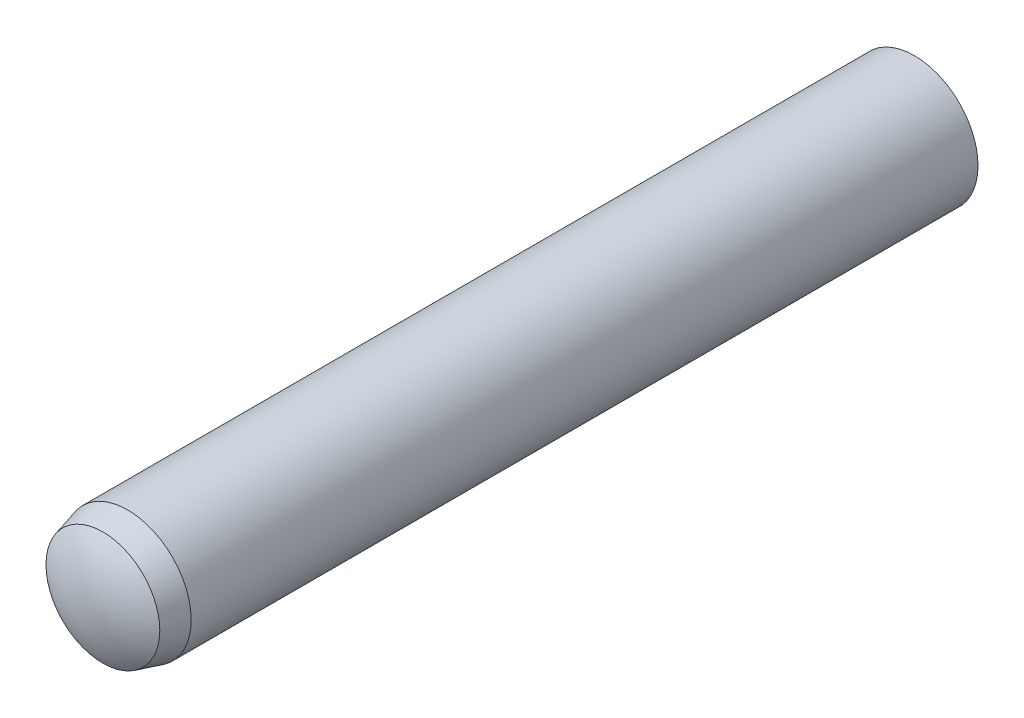
ISO-10303-21;
HEADER;
FILE_DESCRIPTION(('STEP AP214'),'2;1');
FILE_NAME('part.step','',(''),(''),'','','');
FILE_SCHEMA(('AUTOMOTIVE_DESIGN { 1 0 10303 214 1 1 1 1 }'));
ENDSEC;
DATA;
#1=APPLICATION_CONTEXT('core data for automotive mechanical design processes');
#2=APPLICATION_PROTOCOL_DEFINITION('international standard','automotive_design',2000,#1);
#3=PRODUCT_CONTEXT('',#1,'mechanical');
#4=PRODUCT('Part','Part','',(#3));
#5=PRODUCT_RELATED_PRODUCT_CATEGORY('part','',(#4));
#6=PRODUCT_DEFINITION_FORMATION('','',#4);
#7=PRODUCT_DEFINITION_CONTEXT('part definition',#1,'design');
#8=PRODUCT_DEFINITION('design','',#6,#7);
#9=PRODUCT_DEFINITION_SHAPE('','',#8);
#10=(LENGTH_UNIT() NAMED_UNIT(*) SI_UNIT(.MILLI.,.METRE.));
#11=(NAMED_UNIT(*) PLANE_ANGLE_UNIT() SI_UNIT($,.RADIAN.));
#12=(NAMED_UNIT(*) SI_UNIT($,.STERADIAN.) SOLID_ANGLE_UNIT());
#13=UNCERTAINTY_MEASURE_WITH_UNIT(LENGTH_MEASURE(1.E-05),#10,'distance_accuracy_value','');
#14=(GEOMETRIC_REPRESENTATION_CONTEXT(3) GLOBAL_UNCERTAINTY_ASSIGNED_CONTEXT((#13)) GLOBAL_UNIT_ASSIGNED_CONTEXT((#10,
#11,#12)) REPRESENTATION_CONTEXT('',''));
#15=CARTESIAN_POINT('',(0.,0.,0.));
#16=DIRECTION('',(0.,0.,1.));
#17=DIRECTION('',(1.,0.,0.));
#18=AXIS2_PLACEMENT_3D('',#15,#16,#17);
#19=CARTESIAN_POINT('',(0.,0.,-7.27499999999998));
#20=DIRECTION('',(0.,0.,1.));
#21=DIRECTION('',(0.,1.,0.));
#22=AXIS2_PLACEMENT_3D('',#19,#20,#21);
#23=SPHERICAL_SURFACE('',#22,2.72500000000002);
#24=CARTESIAN_POINT('',(0.,0.,-9.55));
#25=DIRECTION('',(0.,0.,1.));
#26=DIRECTION('',(0.,-1.,0.));
#27=AXIS2_PLACEMENT_3D('',#24,#25,#26);
#28=CIRCLE('',#27,1.5);
#29=CARTESIAN_POINT('',(0.,-1.49999999999999,-9.55));
#30=VERTEX_POINT('',#29);
#31=EDGE_CURVE('E10',#30,#30,#28,.T.);
#32=ORIENTED_EDGE('',*,*,#31,.F.);
#33=EDGE_LOOP('',(#32));
#34=FACE_BOUND('',#33,.T.);
#35=ADVANCED_FACE('F35',(#34),#23,.T.);
#36=CARTESIAN_POINT('',(0.,0.,10.));
#37=DIRECTION('',(0.,0.,1.));
#38=DIRECTION('',(0.,-1.,0.));
#39=AXIS2_PLACEMENT_3D('',#36,#37,#38);
#40=CYLINDRICAL_SURFACE('',#39,1.5);
#41=CARTESIAN_POINT('',(0.,0.,9.025));
#42=DIRECTION('',(0.,0.,1.));
#43=DIRECTION('',(0.,-1.,0.));
#44=AXIS2_PLACEMENT_3D('',#41,#42,#43);
#45=CIRCLE('',#44,1.5);
#46=CARTESIAN_POINT('',(0.,-1.5,9.025));
#47=VERTEX_POINT('',#46);
#48=EDGE_CURVE('E41',#47,#47,#45,.T.);
#49=ORIENTED_EDGE('',*,*,#48,.F.);
#50=EDGE_LOOP('',(#49));
#51=FACE_BOUND('',#50,.T.);
#52=ORIENTED_EDGE('',*,*,#31,.T.);
#53=EDGE_LOOP('',(#52));
#54=FACE_BOUND('',#53,.T.);
#55=ADVANCED_FACE('F56',(#51,#54),#40,.T.);
#56=CARTESIAN_POINT('',(0.,0.,9.025));
#57=DIRECTION('',(0.,0.,-1.));
#58=DIRECTION('',(0.,1.,0.));
#59=AXIS2_PLACEMENT_3D('',#56,#57,#58);
#60=CONICAL_SURFACE('',#59,1.5,0.261799387799152);
#61=CARTESIAN_POINT('',(0.,0.,9.61));
#62=DIRECTION('',(0.,0.,1.));
#63=DIRECTION('',(0.,-1.,0.));
#64=AXIS2_PLACEMENT_3D('',#61,#62,#63);
#65=CIRCLE('',#64,1.34324972242779);
#66=CARTESIAN_POINT('',(0.,-1.34324972242779,9.61));
#67=VERTEX_POINT('',#66);
#68=EDGE_CURVE('E45',#67,#67,#65,.T.);
#69=ORIENTED_EDGE('',*,*,#68,.F.);
#70=EDGE_LOOP('',(#69));
#71=FACE_BOUND('',#70,.T.);
#72=ORIENTED_EDGE('',*,*,#48,.T.);
#73=EDGE_LOOP('',(#72));
#74=FACE_BOUND('',#73,.T.);
#75=ADVANCED_FACE('F54',(#71,#74),#60,.T.);
#76=CARTESIAN_POINT('',(0.,0.,7.49176946563802));
#77=DIRECTION('',(0.,0.,1.));
#78=DIRECTION('',(0.,1.,0.));
#79=AXIS2_PLACEMENT_3D('',#76,#77,#78);
#80=SPHERICAL_SURFACE('',#79,2.50823053436198);
#81=ORIENTED_EDGE('',*,*,#68,.T.);
#82=EDGE_LOOP('',(#81));
#83=FACE_BOUND('',#82,.T.);
#84=ADVANCED_FACE('F52',(#83),#80,.T.);
#85=CLOSED_SHELL('',(#35,#55,#75,#84));
#86=MANIFOLD_SOLID_BREP('B2',#85);
#87=ADVANCED_BREP_SHAPE_REPRESENTATION('',(#18,#86),#14);
#88=SHAPE_DEFINITION_REPRESENTATION(#9,#87);
ENDSEC;
END-ISO-10303-21;
